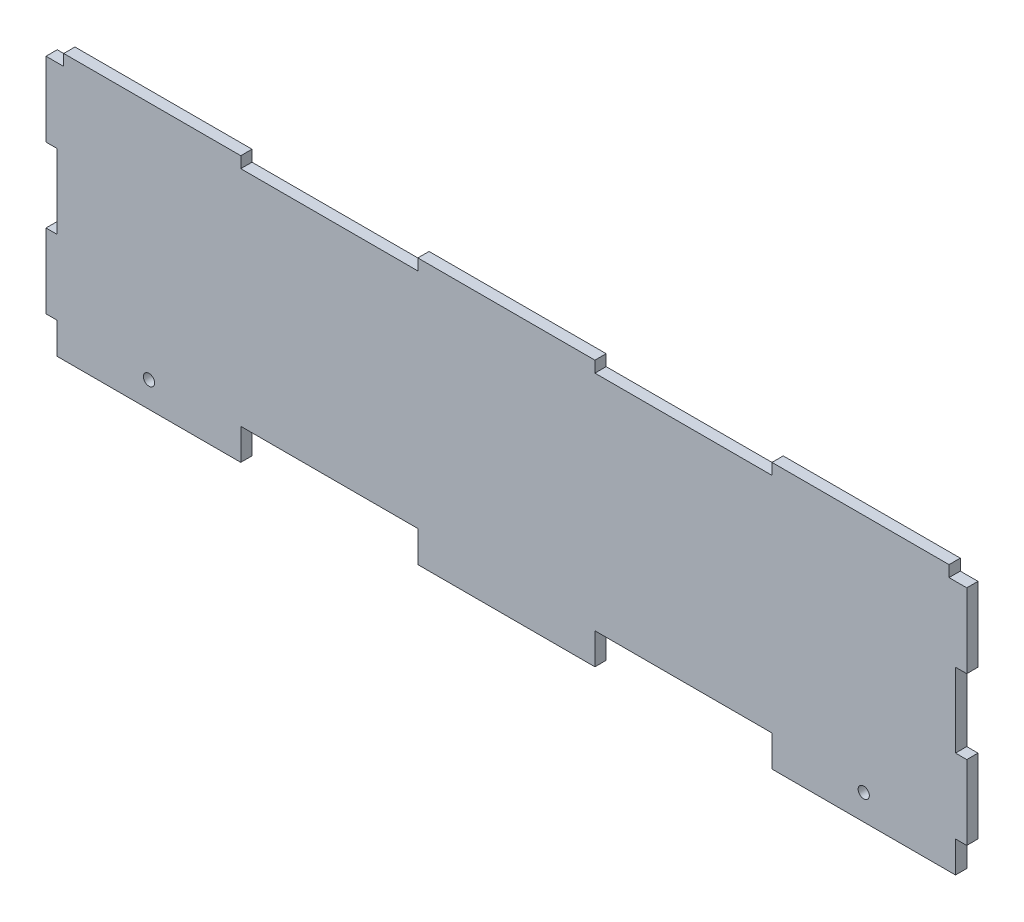
ISO-10303-21;
HEADER;
FILE_DESCRIPTION(('STEP AP214'),'2;1');
FILE_NAME('part.step','',(''),(''),'','','');
FILE_SCHEMA(('AUTOMOTIVE_DESIGN { 1 0 10303 214 1 1 1 1 }'));
ENDSEC;
DATA;
#1=APPLICATION_CONTEXT('core data for automotive mechanical design processes');
#2=APPLICATION_PROTOCOL_DEFINITION('international standard','automotive_design',2000,#1);
#3=PRODUCT_CONTEXT('',#1,'mechanical');
#4=PRODUCT('Part','Part','',(#3));
#5=PRODUCT_RELATED_PRODUCT_CATEGORY('part','',(#4));
#6=PRODUCT_DEFINITION_FORMATION('','',#4);
#7=PRODUCT_DEFINITION_CONTEXT('part definition',#1,'design');
#8=PRODUCT_DEFINITION('design','',#6,#7);
#9=PRODUCT_DEFINITION_SHAPE('','',#8);
#10=(LENGTH_UNIT() NAMED_UNIT(*) SI_UNIT(.MILLI.,.METRE.));
#11=(NAMED_UNIT(*) PLANE_ANGLE_UNIT() SI_UNIT($,.RADIAN.));
#12=(NAMED_UNIT(*) SI_UNIT($,.STERADIAN.) SOLID_ANGLE_UNIT());
#13=UNCERTAINTY_MEASURE_WITH_UNIT(LENGTH_MEASURE(1.E-05),#10,'distance_accuracy_value','');
#14=(GEOMETRIC_REPRESENTATION_CONTEXT(3) GLOBAL_UNCERTAINTY_ASSIGNED_CONTEXT((#13)) GLOBAL_UNIT_ASSIGNED_CONTEXT((#10,
#11,#12)) REPRESENTATION_CONTEXT('',''));
#15=CARTESIAN_POINT('',(0.,0.,0.));
#16=DIRECTION('',(0.,0.,1.));
#17=DIRECTION('',(1.,0.,0.));
#18=AXIS2_PLACEMENT_3D('',#15,#16,#17);
#19=CARTESIAN_POINT('',(155.,0.,3.175));
#20=DIRECTION('',(1.,0.,0.));
#21=DIRECTION('',(0.,0.,-1.));
#22=AXIS2_PLACEMENT_3D('',#19,#20,#21);
#23=PLANE('',#22);
#24=DIRECTION('',(0.,-1.,0.));
#25=VECTOR('',#24,1.);
#26=CARTESIAN_POINT('',(155.,0.,0.));
#27=LINE('',#26,#25);
#28=CARTESIAN_POINT('',(155.,8.82500000000004,0.));
#29=VERTEX_POINT('',#28);
#30=CARTESIAN_POINT('',(155.,0.,0.));
#31=VERTEX_POINT('',#30);
#32=EDGE_CURVE('E381',#29,#31,#27,.T.);
#33=ORIENTED_EDGE('',*,*,#32,.F.);
#34=DIRECTION('',(0.,0.,-1.));
#35=VECTOR('',#34,1.);
#36=CARTESIAN_POINT('',(155.,8.82500000000004,3.175));
#37=LINE('',#36,#35);
#38=CARTESIAN_POINT('',(155.,8.82500000000004,3.175));
#39=VERTEX_POINT('',#38);
#40=EDGE_CURVE('E11',#39,#29,#37,.T.);
#41=ORIENTED_EDGE('',*,*,#40,.F.);
#42=DIRECTION('',(0.,-1.,0.));
#43=VECTOR('',#42,1.);
#44=CARTESIAN_POINT('',(155.,0.,3.175));
#45=LINE('',#44,#43);
#46=CARTESIAN_POINT('',(155.,0.,3.175));
#47=VERTEX_POINT('',#46);
#48=EDGE_CURVE('E482',#39,#47,#45,.T.);
#49=ORIENTED_EDGE('',*,*,#48,.T.);
#50=DIRECTION('',(0.,0.,-1.));
#51=VECTOR('',#50,1.);
#52=CARTESIAN_POINT('',(155.,0.,3.175));
#53=LINE('',#52,#51);
#54=EDGE_CURVE('E170',#47,#31,#53,.T.);
#55=ORIENTED_EDGE('',*,*,#54,.T.);
#56=EDGE_LOOP('',(#33,#41,#49,#55));
#57=FACE_BOUND('',#56,.T.);
#58=ADVANCED_FACE('F35',(#57),#23,.T.);
#59=CARTESIAN_POINT('',(0.,8.82500000000004,3.175));
#60=DIRECTION('',(0.,1.,0.));
#61=DIRECTION('',(0.,0.,1.));
#62=AXIS2_PLACEMENT_3D('',#59,#60,#61);
#63=PLANE('',#62);
#64=DIRECTION('',(1.,0.,0.));
#65=VECTOR('',#64,1.);
#66=CARTESIAN_POINT('',(0.,8.82500000000004,0.));
#67=LINE('',#66,#65);
#68=CARTESIAN_POINT('',(205.,8.82500000000004,0.));
#69=VERTEX_POINT('',#68);
#70=EDGE_CURVE('E379',#29,#69,#67,.T.);
#71=ORIENTED_EDGE('',*,*,#70,.T.);
#72=DIRECTION('',(0.,0.,-1.));
#73=VECTOR('',#72,1.);
#74=CARTESIAN_POINT('',(205.,8.82500000000004,3.175));
#75=LINE('',#74,#73);
#76=CARTESIAN_POINT('',(205.,8.82500000000004,3.175));
#77=VERTEX_POINT('',#76);
#78=EDGE_CURVE('E44',#77,#69,#75,.T.);
#79=ORIENTED_EDGE('',*,*,#78,.F.);
#80=DIRECTION('',(1.,0.,0.));
#81=VECTOR('',#80,1.);
#82=CARTESIAN_POINT('',(0.,8.82500000000004,3.175));
#83=LINE('',#82,#81);
#84=EDGE_CURVE('E481',#39,#77,#83,.T.);
#85=ORIENTED_EDGE('',*,*,#84,.F.);
#86=ORIENTED_EDGE('',*,*,#40,.T.);
#87=EDGE_LOOP('',(#71,#79,#85,#86));
#88=FACE_BOUND('',#87,.T.);
#89=ADVANCED_FACE('F380',(#88),#63,.F.);
#90=CARTESIAN_POINT('',(205.,6.44747082289398E-13,3.175));
#91=DIRECTION('',(1.,0.,0.));
#92=DIRECTION('',(0.,1.,0.));
#93=AXIS2_PLACEMENT_3D('',#90,#91,#92);
#94=PLANE('',#93);
#95=DIRECTION('',(0.,-1.,0.));
#96=VECTOR('',#95,1.);
#97=CARTESIAN_POINT('',(205.,6.44747082289398E-13,0.));
#98=LINE('',#97,#96);
#99=CARTESIAN_POINT('',(205.,0.,0.));
#100=VERTEX_POINT('',#99);
#101=EDGE_CURVE('E373',#69,#100,#98,.T.);
#102=ORIENTED_EDGE('',*,*,#101,.T.);
#103=DIRECTION('',(0.,0.,-1.));
#104=VECTOR('',#103,1.);
#105=CARTESIAN_POINT('',(205.,0.,3.175));
#106=LINE('',#105,#104);
#107=CARTESIAN_POINT('',(205.,0.,3.175));
#108=VERTEX_POINT('',#107);
#109=EDGE_CURVE('E364',#108,#100,#106,.T.);
#110=ORIENTED_EDGE('',*,*,#109,.F.);
#111=DIRECTION('',(0.,-1.,0.));
#112=VECTOR('',#111,1.);
#113=CARTESIAN_POINT('',(205.,6.44747082289398E-13,3.175));
#114=LINE('',#113,#112);
#115=EDGE_CURVE('E375',#77,#108,#114,.T.);
#116=ORIENTED_EDGE('',*,*,#115,.F.);
#117=ORIENTED_EDGE('',*,*,#78,.T.);
#118=EDGE_LOOP('',(#102,#110,#116,#117));
#119=FACE_BOUND('',#118,.T.);
#120=ADVANCED_FACE('F371',(#119),#94,.F.);
#121=CARTESIAN_POINT('',(0.,0.,3.175));
#122=DIRECTION('',(0.,1.,0.));
#123=DIRECTION('',(0.,0.,1.));
#124=AXIS2_PLACEMENT_3D('',#121,#122,#123);
#125=PLANE('',#124);
#126=DIRECTION('',(1.,0.,0.));
#127=VECTOR('',#126,1.);
#128=CARTESIAN_POINT('',(0.,0.,0.));
#129=LINE('',#128,#127);
#130=CARTESIAN_POINT('',(256.825,0.,0.));
#131=VERTEX_POINT('',#130);
#132=EDGE_CURVE('E383',#100,#131,#129,.T.);
#133=ORIENTED_EDGE('',*,*,#132,.T.);
#134=DIRECTION('',(0.,0.,-1.));
#135=VECTOR('',#134,1.);
#136=CARTESIAN_POINT('',(256.825,0.,3.175));
#137=LINE('',#136,#135);
#138=CARTESIAN_POINT('',(256.825,0.,3.175));
#139=VERTEX_POINT('',#138);
#140=EDGE_CURVE('E361',#139,#131,#137,.T.);
#141=ORIENTED_EDGE('',*,*,#140,.F.);
#142=DIRECTION('',(1.,0.,0.));
#143=VECTOR('',#142,1.);
#144=CARTESIAN_POINT('',(0.,0.,3.175));
#145=LINE('',#144,#143);
#146=EDGE_CURVE('E472',#108,#139,#145,.T.);
#147=ORIENTED_EDGE('',*,*,#146,.F.);
#148=ORIENTED_EDGE('',*,*,#109,.T.);
#149=EDGE_LOOP('',(#133,#141,#147,#148));
#150=FACE_BOUND('',#149,.T.);
#151=ADVANCED_FACE('F533',(#150),#125,.F.);
#152=CARTESIAN_POINT('',(256.825,0.,3.175));
#153=DIRECTION('',(-1.,0.,0.));
#154=DIRECTION('',(0.,0.,1.));
#155=AXIS2_PLACEMENT_3D('',#152,#153,#154);
#156=PLANE('',#155);
#157=DIRECTION('',(0.,1.,0.));
#158=VECTOR('',#157,1.);
#159=CARTESIAN_POINT('',(256.825,0.,0.));
#160=LINE('',#159,#158);
#161=CARTESIAN_POINT('',(256.825,8.82500000000004,0.));
#162=VERTEX_POINT('',#161);
#163=EDGE_CURVE('E391',#131,#162,#160,.T.);
#164=ORIENTED_EDGE('',*,*,#163,.T.);
#165=DIRECTION('',(0.,0.,-1.));
#166=VECTOR('',#165,1.);
#167=CARTESIAN_POINT('',(256.825,8.82500000000004,3.175));
#168=LINE('',#167,#166);
#169=CARTESIAN_POINT('',(256.825,8.82500000000004,3.175));
#170=VERTEX_POINT('',#169);
#171=EDGE_CURVE('E358',#170,#162,#168,.T.);
#172=ORIENTED_EDGE('',*,*,#171,.F.);
#173=DIRECTION('',(0.,1.,0.));
#174=VECTOR('',#173,1.);
#175=CARTESIAN_POINT('',(256.825,0.,3.175));
#176=LINE('',#175,#174);
#177=EDGE_CURVE('E477',#139,#170,#176,.T.);
#178=ORIENTED_EDGE('',*,*,#177,.F.);
#179=ORIENTED_EDGE('',*,*,#140,.T.);
#180=EDGE_LOOP('',(#164,#172,#178,#179));
#181=FACE_BOUND('',#180,.T.);
#182=ADVANCED_FACE('F534',(#181),#156,.F.);
#183=CARTESIAN_POINT('',(0.,8.82499999999822,3.175));
#184=DIRECTION('',(0.,1.,0.));
#185=DIRECTION('',(-1.,0.,0.));
#186=AXIS2_PLACEMENT_3D('',#183,#184,#185);
#187=PLANE('',#186);
#188=DIRECTION('',(1.,0.,0.));
#189=VECTOR('',#188,1.);
#190=CARTESIAN_POINT('',(0.,8.82499999999822,0.));
#191=LINE('',#190,#189);
#192=CARTESIAN_POINT('',(260.,8.82500000000005,0.));
#193=VERTEX_POINT('',#192);
#194=EDGE_CURVE('E395',#162,#193,#191,.T.);
#195=ORIENTED_EDGE('',*,*,#194,.T.);
#196=DIRECTION('',(0.,0.,-1.));
#197=VECTOR('',#196,1.);
#198=CARTESIAN_POINT('',(260.,8.82500000000005,3.175));
#199=LINE('',#198,#197);
#200=CARTESIAN_POINT('',(260.,8.82500000000005,3.175));
#201=VERTEX_POINT('',#200);
#202=EDGE_CURVE('E356',#201,#193,#199,.T.);
#203=ORIENTED_EDGE('',*,*,#202,.F.);
#204=DIRECTION('',(1.,0.,0.));
#205=VECTOR('',#204,1.);
#206=CARTESIAN_POINT('',(0.,8.82499999999822,3.175));
#207=LINE('',#206,#205);
#208=EDGE_CURVE('E480',#170,#201,#207,.T.);
#209=ORIENTED_EDGE('',*,*,#208,.F.);
#210=ORIENTED_EDGE('',*,*,#171,.T.);
#211=EDGE_LOOP('',(#195,#203,#209,#210));
#212=FACE_BOUND('',#211,.T.);
#213=ADVANCED_FACE('F537',(#212),#187,.F.);
#214=CARTESIAN_POINT('',(260.,0.,3.175));
#215=DIRECTION('',(1.,0.,0.));
#216=DIRECTION('',(0.,0.,-1.));
#217=AXIS2_PLACEMENT_3D('',#214,#215,#216);
#218=PLANE('',#217);
#219=DIRECTION('',(0.,-1.,0.));
#220=VECTOR('',#219,1.);
#221=CARTESIAN_POINT('',(260.,0.,0.));
#222=LINE('',#221,#220);
#223=CARTESIAN_POINT('',(260.,29.8250000000001,0.));
#224=VERTEX_POINT('',#223);
#225=EDGE_CURVE('E398',#224,#193,#222,.T.);
#226=ORIENTED_EDGE('',*,*,#225,.F.);
#227=DIRECTION('',(0.,0.,-1.));
#228=VECTOR('',#227,1.);
#229=CARTESIAN_POINT('',(260.,29.8250000000001,3.175));
#230=LINE('',#229,#228);
#231=CARTESIAN_POINT('',(260.,29.8250000000001,3.175));
#232=VERTEX_POINT('',#231);
#233=EDGE_CURVE('E354',#232,#224,#230,.T.);
#234=ORIENTED_EDGE('',*,*,#233,.F.);
#235=DIRECTION('',(0.,-1.,0.));
#236=VECTOR('',#235,1.);
#237=CARTESIAN_POINT('',(260.,0.,3.175));
#238=LINE('',#237,#236);
#239=EDGE_CURVE('E894',#232,#201,#238,.T.);
#240=ORIENTED_EDGE('',*,*,#239,.T.);
#241=ORIENTED_EDGE('',*,*,#202,.T.);
#242=EDGE_LOOP('',(#226,#234,#240,#241));
#243=FACE_BOUND('',#242,.T.);
#244=ADVANCED_FACE('F541',(#243),#218,.T.);
#245=CARTESIAN_POINT('',(0.,29.8250000000001,3.175));
#246=DIRECTION('',(0.,1.,0.));
#247=DIRECTION('',(0.,0.,1.));
#248=AXIS2_PLACEMENT_3D('',#245,#246,#247);
#249=PLANE('',#248);
#250=DIRECTION('',(1.,0.,0.));
#251=VECTOR('',#250,1.);
#252=CARTESIAN_POINT('',(0.,29.8250000000001,0.));
#253=LINE('',#252,#251);
#254=CARTESIAN_POINT('',(256.825,29.8250000000001,0.));
#255=VERTEX_POINT('',#254);
#256=EDGE_CURVE('E401',#255,#224,#253,.T.);
#257=ORIENTED_EDGE('',*,*,#256,.F.);
#258=DIRECTION('',(0.,0.,-1.));
#259=VECTOR('',#258,1.);
#260=CARTESIAN_POINT('',(256.825,29.8250000000001,3.175));
#261=LINE('',#260,#259);
#262=CARTESIAN_POINT('',(256.825,29.8250000000001,3.175));
#263=VERTEX_POINT('',#262);
#264=EDGE_CURVE('E352',#263,#255,#261,.T.);
#265=ORIENTED_EDGE('',*,*,#264,.F.);
#266=DIRECTION('',(1.,0.,0.));
#267=VECTOR('',#266,1.);
#268=CARTESIAN_POINT('',(0.,29.8250000000001,3.175));
#269=LINE('',#268,#267);
#270=EDGE_CURVE('E898',#263,#232,#269,.T.);
#271=ORIENTED_EDGE('',*,*,#270,.T.);
#272=ORIENTED_EDGE('',*,*,#233,.T.);
#273=EDGE_LOOP('',(#257,#265,#271,#272));
#274=FACE_BOUND('',#273,.T.);
#275=ADVANCED_FACE('F543',(#274),#249,.T.);
#276=CARTESIAN_POINT('',(256.825,0.,3.175));
#277=DIRECTION('',(1.,0.,0.));
#278=DIRECTION('',(0.,0.,-1.));
#279=AXIS2_PLACEMENT_3D('',#276,#277,#278);
#280=PLANE('',#279);
#281=DIRECTION('',(0.,-1.,0.));
#282=VECTOR('',#281,1.);
#283=CARTESIAN_POINT('',(256.825,0.,0.));
#284=LINE('',#283,#282);
#285=CARTESIAN_POINT('',(256.825,50.8250000000001,0.));
#286=VERTEX_POINT('',#285);
#287=EDGE_CURVE('E405',#286,#255,#284,.T.);
#288=ORIENTED_EDGE('',*,*,#287,.F.);
#289=DIRECTION('',(0.,0.,-1.));
#290=VECTOR('',#289,1.);
#291=CARTESIAN_POINT('',(256.825,50.8250000000001,3.175));
#292=LINE('',#291,#290);
#293=CARTESIAN_POINT('',(256.825,50.8250000000001,3.175));
#294=VERTEX_POINT('',#293);
#295=EDGE_CURVE('E350',#294,#286,#292,.T.);
#296=ORIENTED_EDGE('',*,*,#295,.F.);
#297=DIRECTION('',(0.,-1.,0.));
#298=VECTOR('',#297,1.);
#299=CARTESIAN_POINT('',(256.825,0.,3.175));
#300=LINE('',#299,#298);
#301=EDGE_CURVE('E901',#294,#263,#300,.T.);
#302=ORIENTED_EDGE('',*,*,#301,.T.);
#303=ORIENTED_EDGE('',*,*,#264,.T.);
#304=EDGE_LOOP('',(#288,#296,#302,#303));
#305=FACE_BOUND('',#304,.T.);
#306=ADVANCED_FACE('F546',(#305),#280,.T.);
#307=CARTESIAN_POINT('',(0.,50.8250000000001,3.175));
#308=DIRECTION('',(0.,-1.,0.));
#309=DIRECTION('',(0.,0.,-1.));
#310=AXIS2_PLACEMENT_3D('',#307,#308,#309);
#311=PLANE('',#310);
#312=DIRECTION('',(-1.,0.,0.));
#313=VECTOR('',#312,1.);
#314=CARTESIAN_POINT('',(0.,50.8250000000001,0.));
#315=LINE('',#314,#313);
#316=CARTESIAN_POINT('',(260.,50.8250000000001,0.));
#317=VERTEX_POINT('',#316);
#318=EDGE_CURVE('E408',#317,#286,#315,.T.);
#319=ORIENTED_EDGE('',*,*,#318,.F.);
#320=DIRECTION('',(0.,0.,-1.));
#321=VECTOR('',#320,1.);
#322=CARTESIAN_POINT('',(260.,50.8250000000001,3.175));
#323=LINE('',#322,#321);
#324=CARTESIAN_POINT('',(260.,50.8250000000001,3.175));
#325=VERTEX_POINT('',#324);
#326=EDGE_CURVE('E348',#325,#317,#323,.T.);
#327=ORIENTED_EDGE('',*,*,#326,.F.);
#328=DIRECTION('',(-1.,0.,0.));
#329=VECTOR('',#328,1.);
#330=CARTESIAN_POINT('',(0.,50.8250000000001,3.175));
#331=LINE('',#330,#329);
#332=EDGE_CURVE('E905',#325,#294,#331,.T.);
#333=ORIENTED_EDGE('',*,*,#332,.T.);
#334=ORIENTED_EDGE('',*,*,#295,.T.);
#335=EDGE_LOOP('',(#319,#327,#333,#334));
#336=FACE_BOUND('',#335,.T.);
#337=ADVANCED_FACE('F550',(#336),#311,.T.);
#338=CARTESIAN_POINT('',(260.,71.825,0.));
#339=VERTEX_POINT('',#338);
#340=EDGE_CURVE('E402',#339,#317,#222,.T.);
#341=ORIENTED_EDGE('',*,*,#340,.F.);
#342=DIRECTION('',(0.,0.,-1.));
#343=VECTOR('',#342,1.);
#344=CARTESIAN_POINT('',(260.,71.825,3.175));
#345=LINE('',#344,#343);
#346=CARTESIAN_POINT('',(260.,71.825,3.175));
#347=VERTEX_POINT('',#346);
#348=EDGE_CURVE('E346',#347,#339,#345,.T.);
#349=ORIENTED_EDGE('',*,*,#348,.F.);
#350=EDGE_CURVE('E900',#347,#325,#238,.T.);
#351=ORIENTED_EDGE('',*,*,#350,.T.);
#352=ORIENTED_EDGE('',*,*,#326,.T.);
#353=EDGE_LOOP('',(#341,#349,#351,#352));
#354=FACE_BOUND('',#353,.T.);
#355=ADVANCED_FACE('F554',(#354),#218,.T.);
#356=CARTESIAN_POINT('',(0.,71.825,3.175));
#357=DIRECTION('',(0.,1.,0.));
#358=DIRECTION('',(0.,0.,1.));
#359=AXIS2_PLACEMENT_3D('',#356,#357,#358);
#360=PLANE('',#359);
#361=DIRECTION('',(1.,0.,0.));
#362=VECTOR('',#361,1.);
#363=CARTESIAN_POINT('',(0.,71.825,0.));
#364=LINE('',#363,#362);
#365=CARTESIAN_POINT('',(255.,71.825,0.));
#366=VERTEX_POINT('',#365);
#367=EDGE_CURVE('E411',#366,#339,#364,.T.);
#368=ORIENTED_EDGE('',*,*,#367,.F.);
#369=DIRECTION('',(0.,0.,-1.));
#370=VECTOR('',#369,1.);
#371=CARTESIAN_POINT('',(255.,71.825,3.175));
#372=LINE('',#371,#370);
#373=CARTESIAN_POINT('',(255.,71.825,3.175));
#374=VERTEX_POINT('',#373);
#375=EDGE_CURVE('E344',#374,#366,#372,.T.);
#376=ORIENTED_EDGE('',*,*,#375,.F.);
#377=DIRECTION('',(1.,0.,0.));
#378=VECTOR('',#377,1.);
#379=CARTESIAN_POINT('',(0.,71.825,3.175));
#380=LINE('',#379,#378);
#381=EDGE_CURVE('E904',#374,#347,#380,.T.);
#382=ORIENTED_EDGE('',*,*,#381,.T.);
#383=ORIENTED_EDGE('',*,*,#348,.T.);
#384=EDGE_LOOP('',(#368,#376,#382,#383));
#385=FACE_BOUND('',#384,.T.);
#386=ADVANCED_FACE('F558',(#385),#360,.T.);
#387=CARTESIAN_POINT('',(255.,0.,3.175));
#388=DIRECTION('',(1.,0.,0.));
#389=DIRECTION('',(0.,0.,-1.));
#390=AXIS2_PLACEMENT_3D('',#387,#388,#389);
#391=PLANE('',#390);
#392=DIRECTION('',(0.,-1.,0.));
#393=VECTOR('',#392,1.);
#394=CARTESIAN_POINT('',(255.,0.,0.));
#395=LINE('',#394,#393);
#396=CARTESIAN_POINT('',(255.,75.,0.));
#397=VERTEX_POINT('',#396);
#398=EDGE_CURVE('E414',#397,#366,#395,.T.);
#399=ORIENTED_EDGE('',*,*,#398,.F.);
#400=DIRECTION('',(0.,0.,-1.));
#401=VECTOR('',#400,1.);
#402=CARTESIAN_POINT('',(255.,75.,3.175));
#403=LINE('',#402,#401);
#404=CARTESIAN_POINT('',(255.,75.,3.175));
#405=VERTEX_POINT('',#404);
#406=EDGE_CURVE('E342',#405,#397,#403,.T.);
#407=ORIENTED_EDGE('',*,*,#406,.F.);
#408=DIRECTION('',(0.,-1.,0.));
#409=VECTOR('',#408,1.);
#410=CARTESIAN_POINT('',(255.,0.,3.175));
#411=LINE('',#410,#409);
#412=EDGE_CURVE('E908',#405,#374,#411,.T.);
#413=ORIENTED_EDGE('',*,*,#412,.T.);
#414=ORIENTED_EDGE('',*,*,#375,.T.);
#415=EDGE_LOOP('',(#399,#407,#413,#414));
#416=FACE_BOUND('',#415,.T.);
#417=ADVANCED_FACE('F562',(#416),#391,.T.);
#418=CARTESIAN_POINT('',(0.,75.,3.175));
#419=DIRECTION('',(0.,1.,0.));
#420=DIRECTION('',(0.,0.,1.));
#421=AXIS2_PLACEMENT_3D('',#418,#419,#420);
#422=PLANE('',#421);
#423=DIRECTION('',(1.,0.,0.));
#424=VECTOR('',#423,1.);
#425=CARTESIAN_POINT('',(0.,75.,0.));
#426=LINE('',#425,#424);
#427=CARTESIAN_POINT('',(205.,75.,0.));
#428=VERTEX_POINT('',#427);
#429=EDGE_CURVE('E417',#428,#397,#426,.T.);
#430=ORIENTED_EDGE('',*,*,#429,.F.);
#431=DIRECTION('',(0.,0.,-1.));
#432=VECTOR('',#431,1.);
#433=CARTESIAN_POINT('',(205.,75.,3.175));
#434=LINE('',#433,#432);
#435=CARTESIAN_POINT('',(205.,75.,3.175));
#436=VERTEX_POINT('',#435);
#437=EDGE_CURVE('E340',#436,#428,#434,.T.);
#438=ORIENTED_EDGE('',*,*,#437,.F.);
#439=DIRECTION('',(1.,0.,0.));
#440=VECTOR('',#439,1.);
#441=CARTESIAN_POINT('',(0.,75.,3.175));
#442=LINE('',#441,#440);
#443=EDGE_CURVE('E918',#436,#405,#442,.T.);
#444=ORIENTED_EDGE('',*,*,#443,.T.);
#445=ORIENTED_EDGE('',*,*,#406,.T.);
#446=EDGE_LOOP('',(#430,#438,#444,#445));
#447=FACE_BOUND('',#446,.T.);
#448=ADVANCED_FACE('F566',(#447),#422,.T.);
#449=CARTESIAN_POINT('',(205.,0.,3.175));
#450=DIRECTION('',(-1.,0.,0.));
#451=DIRECTION('',(0.,0.,1.));
#452=AXIS2_PLACEMENT_3D('',#449,#450,#451);
#453=PLANE('',#452);
#454=DIRECTION('',(0.,1.,0.));
#455=VECTOR('',#454,1.);
#456=CARTESIAN_POINT('',(205.,0.,0.));
#457=LINE('',#456,#455);
#458=CARTESIAN_POINT('',(205.,71.825,0.));
#459=VERTEX_POINT('',#458);
#460=EDGE_CURVE('E420',#459,#428,#457,.T.);
#461=ORIENTED_EDGE('',*,*,#460,.F.);
#462=DIRECTION('',(0.,0.,-1.));
#463=VECTOR('',#462,1.);
#464=CARTESIAN_POINT('',(205.,71.825,3.175));
#465=LINE('',#464,#463);
#466=CARTESIAN_POINT('',(205.,71.825,3.175));
#467=VERTEX_POINT('',#466);
#468=EDGE_CURVE('E338',#467,#459,#465,.T.);
#469=ORIENTED_EDGE('',*,*,#468,.F.);
#470=DIRECTION('',(0.,1.,0.));
#471=VECTOR('',#470,1.);
#472=CARTESIAN_POINT('',(205.,0.,3.175));
#473=LINE('',#472,#471);
#474=EDGE_CURVE('E921',#467,#436,#473,.T.);
#475=ORIENTED_EDGE('',*,*,#474,.T.);
#476=ORIENTED_EDGE('',*,*,#437,.T.);
#477=EDGE_LOOP('',(#461,#469,#475,#476));
#478=FACE_BOUND('',#477,.T.);
#479=ADVANCED_FACE('F568',(#478),#453,.T.);
#480=CARTESIAN_POINT('',(0.,71.825,3.175));
#481=DIRECTION('',(0.,1.,0.));
#482=DIRECTION('',(-1.,0.,0.));
#483=AXIS2_PLACEMENT_3D('',#480,#481,#482);
#484=PLANE('',#483);
#485=DIRECTION('',(1.,0.,0.));
#486=VECTOR('',#485,1.);
#487=CARTESIAN_POINT('',(0.,71.825,0.));
#488=LINE('',#487,#486);
#489=CARTESIAN_POINT('',(155.,71.825,0.));
#490=VERTEX_POINT('',#489);
#491=EDGE_CURVE('E425',#490,#459,#488,.T.);
#492=ORIENTED_EDGE('',*,*,#491,.F.);
#493=DIRECTION('',(0.,0.,-1.));
#494=VECTOR('',#493,1.);
#495=CARTESIAN_POINT('',(155.,71.825,3.175));
#496=LINE('',#495,#494);
#497=CARTESIAN_POINT('',(155.,71.825,3.175));
#498=VERTEX_POINT('',#497);
#499=EDGE_CURVE('E336',#498,#490,#496,.T.);
#500=ORIENTED_EDGE('',*,*,#499,.F.);
#501=DIRECTION('',(1.,0.,0.));
#502=VECTOR('',#501,1.);
#503=CARTESIAN_POINT('',(0.,71.825,3.175));
#504=LINE('',#503,#502);
#505=EDGE_CURVE('E926',#498,#467,#504,.T.);
#506=ORIENTED_EDGE('',*,*,#505,.T.);
#507=ORIENTED_EDGE('',*,*,#468,.T.);
#508=EDGE_LOOP('',(#492,#500,#506,#507));
#509=FACE_BOUND('',#508,.T.);
#510=ADVANCED_FACE('F571',(#509),#484,.T.);
#511=CARTESIAN_POINT('',(155.,0.,3.175));
#512=DIRECTION('',(-1.,0.,0.));
#513=DIRECTION('',(0.,0.,1.));
#514=AXIS2_PLACEMENT_3D('',#511,#512,#513);
#515=PLANE('',#514);
#516=DIRECTION('',(0.,1.,0.));
#517=VECTOR('',#516,1.);
#518=CARTESIAN_POINT('',(155.,0.,0.));
#519=LINE('',#518,#517);
#520=CARTESIAN_POINT('',(155.,75.,0.));
#521=VERTEX_POINT('',#520);
#522=EDGE_CURVE('E428',#490,#521,#519,.T.);
#523=ORIENTED_EDGE('',*,*,#522,.T.);
#524=DIRECTION('',(0.,0.,-1.));
#525=VECTOR('',#524,1.);
#526=CARTESIAN_POINT('',(155.,75.,3.175));
#527=LINE('',#526,#525);
#528=CARTESIAN_POINT('',(155.,75.,3.175));
#529=VERTEX_POINT('',#528);
#530=EDGE_CURVE('E334',#529,#521,#527,.T.);
#531=ORIENTED_EDGE('',*,*,#530,.F.);
#532=DIRECTION('',(0.,1.,0.));
#533=VECTOR('',#532,1.);
#534=CARTESIAN_POINT('',(155.,0.,3.175));
#535=LINE('',#534,#533);
#536=EDGE_CURVE('E929',#498,#529,#535,.T.);
#537=ORIENTED_EDGE('',*,*,#536,.F.);
#538=ORIENTED_EDGE('',*,*,#499,.T.);
#539=EDGE_LOOP('',(#523,#531,#537,#538));
#540=FACE_BOUND('',#539,.T.);
#541=ADVANCED_FACE('F575',(#540),#515,.F.);
#542=CARTESIAN_POINT('',(105.,75.,0.));
#543=VERTEX_POINT('',#542);
#544=EDGE_CURVE('E422',#543,#521,#426,.T.);
#545=ORIENTED_EDGE('',*,*,#544,.F.);
#546=DIRECTION('',(0.,0.,-1.));
#547=VECTOR('',#546,1.);
#548=CARTESIAN_POINT('',(105.,75.,3.175));
#549=LINE('',#548,#547);
#550=CARTESIAN_POINT('',(105.,75.,3.175));
#551=VERTEX_POINT('',#550);
#552=EDGE_CURVE('E332',#551,#543,#549,.T.);
#553=ORIENTED_EDGE('',*,*,#552,.F.);
#554=EDGE_CURVE('E923',#551,#529,#442,.T.);
#555=ORIENTED_EDGE('',*,*,#554,.T.);
#556=ORIENTED_EDGE('',*,*,#530,.T.);
#557=EDGE_LOOP('',(#545,#553,#555,#556));
#558=FACE_BOUND('',#557,.T.);
#559=ADVANCED_FACE('F579',(#558),#422,.T.);
#560=CARTESIAN_POINT('',(105.,0.,3.175));
#561=DIRECTION('',(1.,0.,0.));
#562=DIRECTION('',(0.,0.,-1.));
#563=AXIS2_PLACEMENT_3D('',#560,#561,#562);
#564=PLANE('',#563);
#565=DIRECTION('',(0.,-1.,0.));
#566=VECTOR('',#565,1.);
#567=CARTESIAN_POINT('',(105.,0.,0.));
#568=LINE('',#567,#566);
#569=CARTESIAN_POINT('',(105.,71.825,0.));
#570=VERTEX_POINT('',#569);
#571=EDGE_CURVE('E431',#543,#570,#568,.T.);
#572=ORIENTED_EDGE('',*,*,#571,.T.);
#573=DIRECTION('',(0.,0.,-1.));
#574=VECTOR('',#573,1.);
#575=CARTESIAN_POINT('',(105.,71.825,3.175));
#576=LINE('',#575,#574);
#577=CARTESIAN_POINT('',(105.,71.825,3.175));
#578=VERTEX_POINT('',#577);
#579=EDGE_CURVE('E330',#578,#570,#576,.T.);
#580=ORIENTED_EDGE('',*,*,#579,.F.);
#581=DIRECTION('',(0.,-1.,0.));
#582=VECTOR('',#581,1.);
#583=CARTESIAN_POINT('',(105.,0.,3.175));
#584=LINE('',#583,#582);
#585=EDGE_CURVE('E931',#551,#578,#584,.T.);
#586=ORIENTED_EDGE('',*,*,#585,.F.);
#587=ORIENTED_EDGE('',*,*,#552,.T.);
#588=EDGE_LOOP('',(#572,#580,#586,#587));
#589=FACE_BOUND('',#588,.T.);
#590=ADVANCED_FACE('F581',(#589),#564,.F.);
#591=CARTESIAN_POINT('',(0.,71.825,3.175));
#592=DIRECTION('',(0.,1.,0.));
#593=DIRECTION('',(0.,0.,1.));
#594=AXIS2_PLACEMENT_3D('',#591,#592,#593);
#595=PLANE('',#594);
#596=DIRECTION('',(1.,0.,0.));
#597=VECTOR('',#596,1.);
#598=CARTESIAN_POINT('',(0.,71.825,0.));
#599=LINE('',#598,#597);
#600=CARTESIAN_POINT('',(55.,71.825,0.));
#601=VERTEX_POINT('',#600);
#602=EDGE_CURVE('E434',#601,#570,#599,.T.);
#603=ORIENTED_EDGE('',*,*,#602,.F.);
#604=DIRECTION('',(0.,0.,-1.));
#605=VECTOR('',#604,1.);
#606=CARTESIAN_POINT('',(55.,71.825,3.175));
#607=LINE('',#606,#605);
#608=CARTESIAN_POINT('',(55.,71.825,3.175));
#609=VERTEX_POINT('',#608);
#610=EDGE_CURVE('E328',#609,#601,#607,.T.);
#611=ORIENTED_EDGE('',*,*,#610,.F.);
#612=DIRECTION('',(1.,0.,0.));
#613=VECTOR('',#612,1.);
#614=CARTESIAN_POINT('',(0.,71.825,3.175));
#615=LINE('',#614,#613);
#616=EDGE_CURVE('E933',#609,#578,#615,.T.);
#617=ORIENTED_EDGE('',*,*,#616,.T.);
#618=ORIENTED_EDGE('',*,*,#579,.T.);
#619=EDGE_LOOP('',(#603,#611,#617,#618));
#620=FACE_BOUND('',#619,.T.);
#621=ADVANCED_FACE('F584',(#620),#595,.T.);
#622=CARTESIAN_POINT('',(55.,0.,3.175));
#623=DIRECTION('',(-1.,0.,0.));
#624=DIRECTION('',(0.,0.,1.));
#625=AXIS2_PLACEMENT_3D('',#622,#623,#624);
#626=PLANE('',#625);
#627=DIRECTION('',(0.,1.,0.));
#628=VECTOR('',#627,1.);
#629=CARTESIAN_POINT('',(55.,0.,0.));
#630=LINE('',#629,#628);
#631=CARTESIAN_POINT('',(55.,75.,0.));
#632=VERTEX_POINT('',#631);
#633=EDGE_CURVE('E437',#601,#632,#630,.T.);
#634=ORIENTED_EDGE('',*,*,#633,.T.);
#635=DIRECTION('',(0.,0.,-1.));
#636=VECTOR('',#635,1.);
#637=CARTESIAN_POINT('',(55.,75.,3.175));
#638=LINE('',#637,#636);
#639=CARTESIAN_POINT('',(55.,75.,3.175));
#640=VERTEX_POINT('',#639);
#641=EDGE_CURVE('E326',#640,#632,#638,.T.);
#642=ORIENTED_EDGE('',*,*,#641,.F.);
#643=DIRECTION('',(0.,1.,0.));
#644=VECTOR('',#643,1.);
#645=CARTESIAN_POINT('',(55.,0.,3.175));
#646=LINE('',#645,#644);
#647=EDGE_CURVE('E936',#609,#640,#646,.T.);
#648=ORIENTED_EDGE('',*,*,#647,.F.);
#649=ORIENTED_EDGE('',*,*,#610,.T.);
#650=EDGE_LOOP('',(#634,#642,#648,#649));
#651=FACE_BOUND('',#650,.T.);
#652=ADVANCED_FACE('F588',(#651),#626,.F.);
#653=CARTESIAN_POINT('',(5.,75.,0.));
#654=VERTEX_POINT('',#653);
#655=EDGE_CURVE('E421',#654,#632,#426,.T.);
#656=ORIENTED_EDGE('',*,*,#655,.F.);
#657=DIRECTION('',(0.,0.,-1.));
#658=VECTOR('',#657,1.);
#659=CARTESIAN_POINT('',(5.,75.,3.175));
#660=LINE('',#659,#658);
#661=CARTESIAN_POINT('',(5.,75.,3.175));
#662=VERTEX_POINT('',#661);
#663=EDGE_CURVE('E324',#662,#654,#660,.T.);
#664=ORIENTED_EDGE('',*,*,#663,.F.);
#665=EDGE_CURVE('E922',#662,#640,#442,.T.);
#666=ORIENTED_EDGE('',*,*,#665,.T.);
#667=ORIENTED_EDGE('',*,*,#641,.T.);
#668=EDGE_LOOP('',(#656,#664,#666,#667));
#669=FACE_BOUND('',#668,.T.);
#670=ADVANCED_FACE('F592',(#669),#422,.T.);
#671=CARTESIAN_POINT('',(5.,0.,3.175));
#672=DIRECTION('',(1.,0.,0.));
#673=DIRECTION('',(0.,0.,-1.));
#674=AXIS2_PLACEMENT_3D('',#671,#672,#673);
#675=PLANE('',#674);
#676=DIRECTION('',(0.,-1.,0.));
#677=VECTOR('',#676,1.);
#678=CARTESIAN_POINT('',(5.,0.,0.));
#679=LINE('',#678,#677);
#680=CARTESIAN_POINT('',(5.,71.825,0.));
#681=VERTEX_POINT('',#680);
#682=EDGE_CURVE('E440',#654,#681,#679,.T.);
#683=ORIENTED_EDGE('',*,*,#682,.T.);
#684=DIRECTION('',(0.,0.,-1.));
#685=VECTOR('',#684,1.);
#686=CARTESIAN_POINT('',(5.,71.825,3.175));
#687=LINE('',#686,#685);
#688=CARTESIAN_POINT('',(5.,71.825,3.175));
#689=VERTEX_POINT('',#688);
#690=EDGE_CURVE('E321',#689,#681,#687,.T.);
#691=ORIENTED_EDGE('',*,*,#690,.F.);
#692=DIRECTION('',(0.,-1.,0.));
#693=VECTOR('',#692,1.);
#694=CARTESIAN_POINT('',(5.,0.,3.175));
#695=LINE('',#694,#693);
#696=EDGE_CURVE('E938',#662,#689,#695,.T.);
#697=ORIENTED_EDGE('',*,*,#696,.F.);
#698=ORIENTED_EDGE('',*,*,#663,.T.);
#699=EDGE_LOOP('',(#683,#691,#697,#698));
#700=FACE_BOUND('',#699,.T.);
#701=ADVANCED_FACE('F596',(#700),#675,.F.);
#702=CARTESIAN_POINT('',(0.,71.825,3.175));
#703=DIRECTION('',(0.,-1.,0.));
#704=DIRECTION('',(0.,0.,-1.));
#705=AXIS2_PLACEMENT_3D('',#702,#703,#704);
#706=PLANE('',#705);
#707=DIRECTION('',(-1.,0.,0.));
#708=VECTOR('',#707,1.);
#709=CARTESIAN_POINT('',(0.,71.825,0.));
#710=LINE('',#709,#708);
#711=CARTESIAN_POINT('',(0.,71.825,0.));
#712=VERTEX_POINT('',#711);
#713=EDGE_CURVE('E443',#681,#712,#710,.T.);
#714=ORIENTED_EDGE('',*,*,#713,.T.);
#715=DIRECTION('',(0.,0.,-1.));
#716=VECTOR('',#715,1.);
#717=CARTESIAN_POINT('',(0.,71.825,3.175));
#718=LINE('',#717,#716);
#719=CARTESIAN_POINT('',(0.,71.825,3.175));
#720=VERTEX_POINT('',#719);
#721=EDGE_CURVE('E318',#720,#712,#718,.T.);
#722=ORIENTED_EDGE('',*,*,#721,.F.);
#723=DIRECTION('',(-1.,0.,0.));
#724=VECTOR('',#723,1.);
#725=CARTESIAN_POINT('',(0.,71.825,3.175));
#726=LINE('',#725,#724);
#727=EDGE_CURVE('E941',#689,#720,#726,.T.);
#728=ORIENTED_EDGE('',*,*,#727,.F.);
#729=ORIENTED_EDGE('',*,*,#690,.T.);
#730=EDGE_LOOP('',(#714,#722,#728,#729));
#731=FACE_BOUND('',#730,.T.);
#732=ADVANCED_FACE('F600',(#731),#706,.F.);
#733=CARTESIAN_POINT('',(0.,0.,3.175));
#734=DIRECTION('',(1.,0.,0.));
#735=DIRECTION('',(0.,0.,-1.));
#736=AXIS2_PLACEMENT_3D('',#733,#734,#735);
#737=PLANE('',#736);
#738=DIRECTION('',(0.,-1.,0.));
#739=VECTOR('',#738,1.);
#740=CARTESIAN_POINT('',(0.,0.,0.));
#741=LINE('',#740,#739);
#742=CARTESIAN_POINT('',(0.,50.825,0.));
#743=VERTEX_POINT('',#742);
#744=EDGE_CURVE('E446',#712,#743,#741,.T.);
#745=ORIENTED_EDGE('',*,*,#744,.T.);
#746=DIRECTION('',(0.,0.,-1.));
#747=VECTOR('',#746,1.);
#748=CARTESIAN_POINT('',(0.,50.825,3.175));
#749=LINE('',#748,#747);
#750=CARTESIAN_POINT('',(0.,50.825,3.175));
#751=VERTEX_POINT('',#750);
#752=EDGE_CURVE('E316',#751,#743,#749,.T.);
#753=ORIENTED_EDGE('',*,*,#752,.F.);
#754=DIRECTION('',(0.,-1.,0.));
#755=VECTOR('',#754,1.);
#756=CARTESIAN_POINT('',(0.,0.,3.175));
#757=LINE('',#756,#755);
#758=EDGE_CURVE('E944',#720,#751,#757,.T.);
#759=ORIENTED_EDGE('',*,*,#758,.F.);
#760=ORIENTED_EDGE('',*,*,#721,.T.);
#761=EDGE_LOOP('',(#745,#753,#759,#760));
#762=FACE_BOUND('',#761,.T.);
#763=ADVANCED_FACE('F604',(#762),#737,.F.);
#764=CARTESIAN_POINT('',(0.,50.825,3.175));
#765=DIRECTION('',(0.,-1.,0.));
#766=DIRECTION('',(0.,0.,-1.));
#767=AXIS2_PLACEMENT_3D('',#764,#765,#766);
#768=PLANE('',#767);
#769=DIRECTION('',(-1.,0.,0.));
#770=VECTOR('',#769,1.);
#771=CARTESIAN_POINT('',(0.,50.825,0.));
#772=LINE('',#771,#770);
#773=CARTESIAN_POINT('',(3.175,50.825,0.));
#774=VERTEX_POINT('',#773);
#775=EDGE_CURVE('E449',#774,#743,#772,.T.);
#776=ORIENTED_EDGE('',*,*,#775,.F.);
#777=DIRECTION('',(0.,0.,-1.));
#778=VECTOR('',#777,1.);
#779=CARTESIAN_POINT('',(3.175,50.825,3.175));
#780=LINE('',#779,#778);
#781=CARTESIAN_POINT('',(3.175,50.825,3.175));
#782=VERTEX_POINT('',#781);
#783=EDGE_CURVE('E314',#782,#774,#780,.T.);
#784=ORIENTED_EDGE('',*,*,#783,.F.);
#785=DIRECTION('',(-1.,0.,0.));
#786=VECTOR('',#785,1.);
#787=CARTESIAN_POINT('',(0.,50.825,3.175));
#788=LINE('',#787,#786);
#789=EDGE_CURVE('E946',#782,#751,#788,.T.);
#790=ORIENTED_EDGE('',*,*,#789,.T.);
#791=ORIENTED_EDGE('',*,*,#752,.T.);
#792=EDGE_LOOP('',(#776,#784,#790,#791));
#793=FACE_BOUND('',#792,.T.);
#794=ADVANCED_FACE('F606',(#793),#768,.T.);
#795=CARTESIAN_POINT('',(3.17500000000001,0.,3.175));
#796=DIRECTION('',(1.,0.,0.));
#797=DIRECTION('',(0.,1.,0.));
#798=AXIS2_PLACEMENT_3D('',#795,#796,#797);
#799=PLANE('',#798);
#800=DIRECTION('',(0.,-1.,0.));
#801=VECTOR('',#800,1.);
#802=CARTESIAN_POINT('',(3.17500000000001,0.,0.));
#803=LINE('',#802,#801);
#804=CARTESIAN_POINT('',(3.17500000000001,29.8250000000001,0.));
#805=VERTEX_POINT('',#804);
#806=EDGE_CURVE('E453',#774,#805,#803,.T.);
#807=ORIENTED_EDGE('',*,*,#806,.T.);
#808=DIRECTION('',(0.,0.,-1.));
#809=VECTOR('',#808,1.);
#810=CARTESIAN_POINT('',(3.17500000000001,29.8250000000001,3.175));
#811=LINE('',#810,#809);
#812=CARTESIAN_POINT('',(3.17500000000001,29.8250000000001,3.175));
#813=VERTEX_POINT('',#812);
#814=EDGE_CURVE('E311',#813,#805,#811,.T.);
#815=ORIENTED_EDGE('',*,*,#814,.F.);
#816=DIRECTION('',(0.,-1.,0.));
#817=VECTOR('',#816,1.);
#818=CARTESIAN_POINT('',(3.17500000000001,0.,3.175));
#819=LINE('',#818,#817);
#820=EDGE_CURVE('E950',#782,#813,#819,.T.);
#821=ORIENTED_EDGE('',*,*,#820,.F.);
#822=ORIENTED_EDGE('',*,*,#783,.T.);
#823=EDGE_LOOP('',(#807,#815,#821,#822));
#824=FACE_BOUND('',#823,.T.);
#825=ADVANCED_FACE('F609',(#824),#799,.F.);
#826=CARTESIAN_POINT('',(0.,29.8250000000001,3.175));
#827=DIRECTION('',(0.,-1.,0.));
#828=DIRECTION('',(0.,0.,-1.));
#829=AXIS2_PLACEMENT_3D('',#826,#827,#828);
#830=PLANE('',#829);
#831=DIRECTION('',(-1.,0.,0.));
#832=VECTOR('',#831,1.);
#833=CARTESIAN_POINT('',(0.,29.8250000000001,0.));
#834=LINE('',#833,#832);
#835=CARTESIAN_POINT('',(0.,29.8250000000001,0.));
#836=VERTEX_POINT('',#835);
#837=EDGE_CURVE('E456',#805,#836,#834,.T.);
#838=ORIENTED_EDGE('',*,*,#837,.T.);
#839=DIRECTION('',(0.,0.,-1.));
#840=VECTOR('',#839,1.);
#841=CARTESIAN_POINT('',(0.,29.8250000000001,3.175));
#842=LINE('',#841,#840);
#843=CARTESIAN_POINT('',(0.,29.8250000000001,3.175));
#844=VERTEX_POINT('',#843);
#845=EDGE_CURVE('E308',#844,#836,#842,.T.);
#846=ORIENTED_EDGE('',*,*,#845,.F.);
#847=DIRECTION('',(-1.,0.,0.));
#848=VECTOR('',#847,1.);
#849=CARTESIAN_POINT('',(0.,29.8250000000001,3.175));
#850=LINE('',#849,#848);
#851=EDGE_CURVE('E953',#813,#844,#850,.T.);
#852=ORIENTED_EDGE('',*,*,#851,.F.);
#853=ORIENTED_EDGE('',*,*,#814,.T.);
#854=EDGE_LOOP('',(#838,#846,#852,#853));
#855=FACE_BOUND('',#854,.T.);
#856=ADVANCED_FACE('F613',(#855),#830,.F.);
#857=CARTESIAN_POINT('',(0.,8.825,0.));
#858=VERTEX_POINT('',#857);
#859=EDGE_CURVE('E450',#836,#858,#741,.T.);
#860=ORIENTED_EDGE('',*,*,#859,.T.);
#861=DIRECTION('',(0.,0.,-1.));
#862=VECTOR('',#861,1.);
#863=CARTESIAN_POINT('',(0.,8.825,3.175));
#864=LINE('',#863,#862);
#865=CARTESIAN_POINT('',(0.,8.825,3.175));
#866=VERTEX_POINT('',#865);
#867=EDGE_CURVE('E306',#866,#858,#864,.T.);
#868=ORIENTED_EDGE('',*,*,#867,.F.);
#869=EDGE_CURVE('E947',#844,#866,#757,.T.);
#870=ORIENTED_EDGE('',*,*,#869,.F.);
#871=ORIENTED_EDGE('',*,*,#845,.T.);
#872=EDGE_LOOP('',(#860,#868,#870,#871));
#873=FACE_BOUND('',#872,.T.);
#874=ADVANCED_FACE('F617',(#873),#737,.F.);
#875=CARTESIAN_POINT('',(0.,8.825,3.175));
#876=DIRECTION('',(0.,-1.,0.));
#877=DIRECTION('',(1.,0.,0.));
#878=AXIS2_PLACEMENT_3D('',#875,#876,#877);
#879=PLANE('',#878);
#880=DIRECTION('',(-1.,0.,0.));
#881=VECTOR('',#880,1.);
#882=CARTESIAN_POINT('',(0.,8.825,0.));
#883=LINE('',#882,#881);
#884=CARTESIAN_POINT('',(3.175,8.82500000000001,0.));
#885=VERTEX_POINT('',#884);
#886=EDGE_CURVE('E459',#885,#858,#883,.T.);
#887=ORIENTED_EDGE('',*,*,#886,.F.);
#888=DIRECTION('',(0.,0.,-1.));
#889=VECTOR('',#888,1.);
#890=CARTESIAN_POINT('',(3.175,8.82500000000001,3.175));
#891=LINE('',#890,#889);
#892=CARTESIAN_POINT('',(3.175,8.82500000000001,3.175));
#893=VERTEX_POINT('',#892);
#894=EDGE_CURVE('E304',#893,#885,#891,.T.);
#895=ORIENTED_EDGE('',*,*,#894,.F.);
#896=DIRECTION('',(-1.,0.,0.));
#897=VECTOR('',#896,1.);
#898=CARTESIAN_POINT('',(0.,8.825,3.175));
#899=LINE('',#898,#897);
#900=EDGE_CURVE('E955',#893,#866,#899,.T.);
#901=ORIENTED_EDGE('',*,*,#900,.T.);
#902=ORIENTED_EDGE('',*,*,#867,.T.);
#903=EDGE_LOOP('',(#887,#895,#901,#902));
#904=FACE_BOUND('',#903,.T.);
#905=ADVANCED_FACE('F621',(#904),#879,.T.);
#906=CARTESIAN_POINT('',(3.17500000000001,0.,3.175));
#907=DIRECTION('',(-1.,0.,0.));
#908=DIRECTION('',(0.,-1.,0.));
#909=AXIS2_PLACEMENT_3D('',#906,#907,#908);
#910=PLANE('',#909);
#911=DIRECTION('',(0.,1.,0.));
#912=VECTOR('',#911,1.);
#913=CARTESIAN_POINT('',(3.17500000000001,0.,0.));
#914=LINE('',#913,#912);
#915=CARTESIAN_POINT('',(3.17500000000001,0.,0.));
#916=VERTEX_POINT('',#915);
#917=EDGE_CURVE('E462',#916,#885,#914,.T.);
#918=ORIENTED_EDGE('',*,*,#917,.F.);
#919=DIRECTION('',(0.,0.,-1.));
#920=VECTOR('',#919,1.);
#921=CARTESIAN_POINT('',(3.17500000000001,0.,3.175));
#922=LINE('',#921,#920);
#923=CARTESIAN_POINT('',(3.17500000000001,0.,3.175));
#924=VERTEX_POINT('',#923);
#925=EDGE_CURVE('E302',#924,#916,#922,.T.);
#926=ORIENTED_EDGE('',*,*,#925,.F.);
#927=DIRECTION('',(0.,1.,0.));
#928=VECTOR('',#927,1.);
#929=CARTESIAN_POINT('',(3.17500000000001,0.,3.175));
#930=LINE('',#929,#928);
#931=EDGE_CURVE('E475',#924,#893,#930,.T.);
#932=ORIENTED_EDGE('',*,*,#931,.T.);
#933=ORIENTED_EDGE('',*,*,#894,.T.);
#934=EDGE_LOOP('',(#918,#926,#932,#933));
#935=FACE_BOUND('',#934,.T.);
#936=ADVANCED_FACE('F625',(#935),#910,.T.);
#937=CARTESIAN_POINT('',(55.,0.,0.));
#938=VERTEX_POINT('',#937);
#939=EDGE_CURVE('E392',#916,#938,#129,.T.);
#940=ORIENTED_EDGE('',*,*,#939,.T.);
#941=DIRECTION('',(0.,0.,-1.));
#942=VECTOR('',#941,1.);
#943=CARTESIAN_POINT('',(55.,0.,3.175));
#944=LINE('',#943,#942);
#945=CARTESIAN_POINT('',(55.,0.,3.175));
#946=VERTEX_POINT('',#945);
#947=EDGE_CURVE('E296',#946,#938,#944,.T.);
#948=ORIENTED_EDGE('',*,*,#947,.F.);
#949=EDGE_CURVE('E471',#924,#946,#145,.T.);
#950=ORIENTED_EDGE('',*,*,#949,.F.);
#951=ORIENTED_EDGE('',*,*,#925,.T.);
#952=EDGE_LOOP('',(#940,#948,#950,#951));
#953=FACE_BOUND('',#952,.T.);
#954=ADVANCED_FACE('F498',(#953),#125,.F.);
#955=CARTESIAN_POINT('',(55.,0.,3.175));
#956=DIRECTION('',(1.,0.,0.));
#957=DIRECTION('',(0.,1.,0.));
#958=AXIS2_PLACEMENT_3D('',#955,#956,#957);
#959=PLANE('',#958);
#960=DIRECTION('',(0.,-1.,0.));
#961=VECTOR('',#960,1.);
#962=CARTESIAN_POINT('',(55.,0.,0.));
#963=LINE('',#962,#961);
#964=CARTESIAN_POINT('',(55.,8.82500000000001,0.));
#965=VERTEX_POINT('',#964);
#966=EDGE_CURVE('E465',#965,#938,#963,.T.);
#967=ORIENTED_EDGE('',*,*,#966,.F.);
#968=DIRECTION('',(0.,0.,-1.));
#969=VECTOR('',#968,1.);
#970=CARTESIAN_POINT('',(55.,8.82500000000001,3.175));
#971=LINE('',#970,#969);
#972=CARTESIAN_POINT('',(55.,8.82500000000001,3.175));
#973=VERTEX_POINT('',#972);
#974=EDGE_CURVE('E294',#973,#965,#971,.T.);
#975=ORIENTED_EDGE('',*,*,#974,.F.);
#976=DIRECTION('',(0.,-1.,0.));
#977=VECTOR('',#976,1.);
#978=CARTESIAN_POINT('',(55.,0.,3.175));
#979=LINE('',#978,#977);
#980=EDGE_CURVE('E288',#973,#946,#979,.T.);
#981=ORIENTED_EDGE('',*,*,#980,.T.);
#982=ORIENTED_EDGE('',*,*,#947,.T.);
#983=EDGE_LOOP('',(#967,#975,#981,#982));
#984=FACE_BOUND('',#983,.T.);
#985=ADVANCED_FACE('F504',(#984),#959,.T.);
#986=CARTESIAN_POINT('',(0.,8.82500000000001,3.175));
#987=DIRECTION('',(0.,1.,0.));
#988=DIRECTION('',(0.,0.,1.));
#989=AXIS2_PLACEMENT_3D('',#986,#987,#988);
#990=PLANE('',#989);
#991=DIRECTION('',(1.,0.,0.));
#992=VECTOR('',#991,1.);
#993=CARTESIAN_POINT('',(0.,8.82500000000001,0.));
#994=LINE('',#993,#992);
#995=CARTESIAN_POINT('',(105.,8.82500000000001,0.));
#996=VERTEX_POINT('',#995);
#997=EDGE_CURVE('E293',#965,#996,#994,.T.);
#998=ORIENTED_EDGE('',*,*,#997,.T.);
#999=DIRECTION('',(0.,0.,-1.));
#1000=VECTOR('',#999,1.);
#1001=CARTESIAN_POINT('',(105.,8.82500000000001,3.175));
#1002=LINE('',#1001,#1000);
#1003=CARTESIAN_POINT('',(105.,8.82500000000001,3.175));
#1004=VERTEX_POINT('',#1003);
#1005=EDGE_CURVE('E279',#1004,#996,#1002,.T.);
#1006=ORIENTED_EDGE('',*,*,#1005,.F.);
#1007=DIRECTION('',(1.,0.,0.));
#1008=VECTOR('',#1007,1.);
#1009=CARTESIAN_POINT('',(0.,8.82500000000001,3.175));
#1010=LINE('',#1009,#1008);
#1011=EDGE_CURVE('E282',#973,#1004,#1010,.T.);
#1012=ORIENTED_EDGE('',*,*,#1011,.F.);
#1013=ORIENTED_EDGE('',*,*,#974,.T.);
#1014=EDGE_LOOP('',(#998,#1006,#1012,#1013));
#1015=FACE_BOUND('',#1014,.T.);
#1016=ADVANCED_FACE('F291',(#1015),#990,.F.);
#1017=CARTESIAN_POINT('',(105.,0.,3.175));
#1018=DIRECTION('',(1.,0.,0.));
#1019=DIRECTION('',(0.,0.,-1.));
#1020=AXIS2_PLACEMENT_3D('',#1017,#1018,#1019);
#1021=PLANE('',#1020);
#1022=DIRECTION('',(0.,-1.,0.));
#1023=VECTOR('',#1022,1.);
#1024=CARTESIAN_POINT('',(105.,0.,0.));
#1025=LINE('',#1024,#1023);
#1026=CARTESIAN_POINT('',(105.,0.,0.));
#1027=VERTEX_POINT('',#1026);
#1028=EDGE_CURVE('E469',#996,#1027,#1025,.T.);
#1029=ORIENTED_EDGE('',*,*,#1028,.T.);
#1030=DIRECTION('',(0.,0.,-1.));
#1031=VECTOR('',#1030,1.);
#1032=CARTESIAN_POINT('',(105.,0.,3.175));
#1033=LINE('',#1032,#1031);
#1034=CARTESIAN_POINT('',(105.,0.,3.175));
#1035=VERTEX_POINT('',#1034);
#1036=EDGE_CURVE('E281',#1035,#1027,#1033,.T.);
#1037=ORIENTED_EDGE('',*,*,#1036,.F.);
#1038=DIRECTION('',(0.,-1.,0.));
#1039=VECTOR('',#1038,1.);
#1040=CARTESIAN_POINT('',(105.,0.,3.175));
#1041=LINE('',#1040,#1039);
#1042=EDGE_CURVE('E274',#1004,#1035,#1041,.T.);
#1043=ORIENTED_EDGE('',*,*,#1042,.F.);
#1044=ORIENTED_EDGE('',*,*,#1005,.T.);
#1045=EDGE_LOOP('',(#1029,#1037,#1043,#1044));
#1046=FACE_BOUND('',#1045,.T.);
#1047=ADVANCED_FACE('F277',(#1046),#1021,.F.);
#1048=CARTESIAN_POINT('',(29.0875,7.23749999999999,3.175));
#1049=DIRECTION('',(0.,0.,-1.));
#1050=DIRECTION('',(-1.,0.,0.));
#1051=AXIS2_PLACEMENT_3D('',#1048,#1049,#1050);
#1052=CYLINDRICAL_SURFACE('',#1051,1.575);
#1053=CARTESIAN_POINT('',(29.0875,7.23749999999999,3.175));
#1054=DIRECTION('',(0.,0.,1.));
#1055=DIRECTION('',(1.,0.,0.));
#1056=AXIS2_PLACEMENT_3D('',#1053,#1054,#1055);
#1057=CIRCLE('',#1056,1.575);
#1058=CARTESIAN_POINT('',(30.6625,7.23749999999999,3.175));
#1059=VERTEX_POINT('',#1058);
#1060=EDGE_CURVE('E486',#1059,#1059,#1057,.T.);
#1061=ORIENTED_EDGE('',*,*,#1060,.T.);
#1062=EDGE_LOOP('',(#1061));
#1063=FACE_BOUND('',#1062,.T.);
#1064=CARTESIAN_POINT('',(29.0875,7.23749999999999,0.));
#1065=DIRECTION('',(0.,0.,1.));
#1066=DIRECTION('',(1.,0.,0.));
#1067=AXIS2_PLACEMENT_3D('',#1064,#1065,#1066);
#1068=CIRCLE('',#1067,1.575);
#1069=CARTESIAN_POINT('',(30.6625,7.23749999999999,0.));
#1070=VERTEX_POINT('',#1069);
#1071=EDGE_CURVE('E385',#1070,#1070,#1068,.T.);
#1072=ORIENTED_EDGE('',*,*,#1071,.F.);
#1073=EDGE_LOOP('',(#1072));
#1074=FACE_BOUND('',#1073,.T.);
#1075=ADVANCED_FACE('F515',(#1063,#1074),#1052,.F.);
#1076=CARTESIAN_POINT('',(230.9125,7.23750000000002,3.175));
#1077=DIRECTION('',(0.,0.,-1.));
#1078=DIRECTION('',(-1.,0.,0.));
#1079=AXIS2_PLACEMENT_3D('',#1076,#1077,#1078);
#1080=CYLINDRICAL_SURFACE('',#1079,1.57500000000001);
#1081=CARTESIAN_POINT('',(230.9125,7.23750000000002,3.175));
#1082=DIRECTION('',(0.,0.,1.));
#1083=DIRECTION('',(1.,0.,0.));
#1084=AXIS2_PLACEMENT_3D('',#1081,#1082,#1083);
#1085=CIRCLE('',#1084,1.57500000000001);
#1086=CARTESIAN_POINT('',(232.4875,7.23750000000002,3.175));
#1087=VERTEX_POINT('',#1086);
#1088=EDGE_CURVE('E489',#1087,#1087,#1085,.T.);
#1089=ORIENTED_EDGE('',*,*,#1088,.T.);
#1090=EDGE_LOOP('',(#1089));
#1091=FACE_BOUND('',#1090,.T.);
#1092=CARTESIAN_POINT('',(230.9125,7.23750000000002,0.));
#1093=DIRECTION('',(0.,0.,1.));
#1094=DIRECTION('',(1.,0.,0.));
#1095=AXIS2_PLACEMENT_3D('',#1092,#1093,#1094);
#1096=CIRCLE('',#1095,1.57500000000001);
#1097=CARTESIAN_POINT('',(232.4875,7.23750000000002,0.));
#1098=VERTEX_POINT('',#1097);
#1099=EDGE_CURVE('E509',#1098,#1098,#1096,.T.);
#1100=ORIENTED_EDGE('',*,*,#1099,.F.);
#1101=EDGE_LOOP('',(#1100));
#1102=FACE_BOUND('',#1101,.T.);
#1103=ADVANCED_FACE('F37',(#1091,#1102),#1080,.F.);
#1104=EDGE_CURVE('E163',#1027,#31,#129,.T.);
#1105=ORIENTED_EDGE('',*,*,#1104,.T.);
#1106=ORIENTED_EDGE('',*,*,#54,.F.);
#1107=EDGE_CURVE('E52',#1035,#47,#145,.T.);
#1108=ORIENTED_EDGE('',*,*,#1107,.F.);
#1109=ORIENTED_EDGE('',*,*,#1036,.T.);
#1110=EDGE_LOOP('',(#1105,#1106,#1108,#1109));
#1111=FACE_BOUND('',#1110,.T.);
#1112=ADVANCED_FACE('F522',(#1111),#125,.F.);
#1113=CARTESIAN_POINT('',(0.,0.,3.175));
#1114=DIRECTION('',(0.,0.,1.));
#1115=DIRECTION('',(1.,0.,0.));
#1116=AXIS2_PLACEMENT_3D('',#1113,#1114,#1115);
#1117=PLANE('',#1116);
#1118=ORIENTED_EDGE('',*,*,#1088,.F.);
#1119=EDGE_LOOP('',(#1118));
#1120=FACE_BOUND('',#1119,.T.);
#1121=ORIENTED_EDGE('',*,*,#1060,.F.);
#1122=EDGE_LOOP('',(#1121));
#1123=FACE_BOUND('',#1122,.T.);
#1124=ORIENTED_EDGE('',*,*,#48,.F.);
#1125=ORIENTED_EDGE('',*,*,#84,.T.);
#1126=ORIENTED_EDGE('',*,*,#115,.T.);
#1127=ORIENTED_EDGE('',*,*,#146,.T.);
#1128=ORIENTED_EDGE('',*,*,#177,.T.);
#1129=ORIENTED_EDGE('',*,*,#208,.T.);
#1130=ORIENTED_EDGE('',*,*,#239,.F.);
#1131=ORIENTED_EDGE('',*,*,#270,.F.);
#1132=ORIENTED_EDGE('',*,*,#301,.F.);
#1133=ORIENTED_EDGE('',*,*,#332,.F.);
#1134=ORIENTED_EDGE('',*,*,#350,.F.);
#1135=ORIENTED_EDGE('',*,*,#381,.F.);
#1136=ORIENTED_EDGE('',*,*,#412,.F.);
#1137=ORIENTED_EDGE('',*,*,#443,.F.);
#1138=ORIENTED_EDGE('',*,*,#474,.F.);
#1139=ORIENTED_EDGE('',*,*,#505,.F.);
#1140=ORIENTED_EDGE('',*,*,#536,.T.);
#1141=ORIENTED_EDGE('',*,*,#554,.F.);
#1142=ORIENTED_EDGE('',*,*,#585,.T.);
#1143=ORIENTED_EDGE('',*,*,#616,.F.);
#1144=ORIENTED_EDGE('',*,*,#647,.T.);
#1145=ORIENTED_EDGE('',*,*,#665,.F.);
#1146=ORIENTED_EDGE('',*,*,#696,.T.);
#1147=ORIENTED_EDGE('',*,*,#727,.T.);
#1148=ORIENTED_EDGE('',*,*,#758,.T.);
#1149=ORIENTED_EDGE('',*,*,#789,.F.);
#1150=ORIENTED_EDGE('',*,*,#820,.T.);
#1151=ORIENTED_EDGE('',*,*,#851,.T.);
#1152=ORIENTED_EDGE('',*,*,#869,.T.);
#1153=ORIENTED_EDGE('',*,*,#900,.F.);
#1154=ORIENTED_EDGE('',*,*,#931,.F.);
#1155=ORIENTED_EDGE('',*,*,#949,.T.);
#1156=ORIENTED_EDGE('',*,*,#980,.F.);
#1157=ORIENTED_EDGE('',*,*,#1011,.T.);
#1158=ORIENTED_EDGE('',*,*,#1042,.T.);
#1159=ORIENTED_EDGE('',*,*,#1107,.T.);
#1160=EDGE_LOOP('',(#1124,#1125,#1126,#1127,#1128,#1129,#1130,#1131,#1132,#1133,#1134,#1135,
#1136,#1137,#1138,#1139,#1140,#1141,#1142,#1143,#1144,#1145,#1146,#1147,#1148,#1149,#1150,#1151,
#1152,#1153,#1154,#1155,#1156,#1157,#1158,#1159));
#1161=FACE_BOUND('',#1160,.T.);
#1162=ADVANCED_FACE('F286',(#1120,#1123,#1161),#1117,.T.);
#1163=CARTESIAN_POINT('',(0.,0.,0.));
#1164=DIRECTION('',(0.,0.,1.));
#1165=DIRECTION('',(1.,0.,0.));
#1166=AXIS2_PLACEMENT_3D('',#1163,#1164,#1165);
#1167=PLANE('',#1166);
#1168=ORIENTED_EDGE('',*,*,#1099,.T.);
#1169=EDGE_LOOP('',(#1168));
#1170=FACE_BOUND('',#1169,.T.);
#1171=ORIENTED_EDGE('',*,*,#1071,.T.);
#1172=EDGE_LOOP('',(#1171));
#1173=FACE_BOUND('',#1172,.T.);
#1174=ORIENTED_EDGE('',*,*,#32,.T.);
#1175=ORIENTED_EDGE('',*,*,#1104,.F.);
#1176=ORIENTED_EDGE('',*,*,#1028,.F.);
#1177=ORIENTED_EDGE('',*,*,#997,.F.);
#1178=ORIENTED_EDGE('',*,*,#966,.T.);
#1179=ORIENTED_EDGE('',*,*,#939,.F.);
#1180=ORIENTED_EDGE('',*,*,#917,.T.);
#1181=ORIENTED_EDGE('',*,*,#886,.T.);
#1182=ORIENTED_EDGE('',*,*,#859,.F.);
#1183=ORIENTED_EDGE('',*,*,#837,.F.);
#1184=ORIENTED_EDGE('',*,*,#806,.F.);
#1185=ORIENTED_EDGE('',*,*,#775,.T.);
#1186=ORIENTED_EDGE('',*,*,#744,.F.);
#1187=ORIENTED_EDGE('',*,*,#713,.F.);
#1188=ORIENTED_EDGE('',*,*,#682,.F.);
#1189=ORIENTED_EDGE('',*,*,#655,.T.);
#1190=ORIENTED_EDGE('',*,*,#633,.F.);
#1191=ORIENTED_EDGE('',*,*,#602,.T.);
#1192=ORIENTED_EDGE('',*,*,#571,.F.);
#1193=ORIENTED_EDGE('',*,*,#544,.T.);
#1194=ORIENTED_EDGE('',*,*,#522,.F.);
#1195=ORIENTED_EDGE('',*,*,#491,.T.);
#1196=ORIENTED_EDGE('',*,*,#460,.T.);
#1197=ORIENTED_EDGE('',*,*,#429,.T.);
#1198=ORIENTED_EDGE('',*,*,#398,.T.);
#1199=ORIENTED_EDGE('',*,*,#367,.T.);
#1200=ORIENTED_EDGE('',*,*,#340,.T.);
#1201=ORIENTED_EDGE('',*,*,#318,.T.);
#1202=ORIENTED_EDGE('',*,*,#287,.T.);
#1203=ORIENTED_EDGE('',*,*,#256,.T.);
#1204=ORIENTED_EDGE('',*,*,#225,.T.);
#1205=ORIENTED_EDGE('',*,*,#194,.F.);
#1206=ORIENTED_EDGE('',*,*,#163,.F.);
#1207=ORIENTED_EDGE('',*,*,#132,.F.);
#1208=ORIENTED_EDGE('',*,*,#101,.F.);
#1209=ORIENTED_EDGE('',*,*,#70,.F.);
#1210=EDGE_LOOP('',(#1174,#1175,#1176,#1177,#1178,#1179,#1180,#1181,#1182,#1183,#1184,#1185,
#1186,#1187,#1188,#1189,#1190,#1191,#1192,#1193,#1194,#1195,#1196,#1197,#1198,#1199,#1200,#1201,
#1202,#1203,#1204,#1205,#1206,#1207,#1208,#1209));
#1211=FACE_BOUND('',#1210,.T.);
#1212=ADVANCED_FACE('F502',(#1170,#1173,#1211),#1167,.F.);
#1213=CLOSED_SHELL('',(#58,#89,#120,#151,#182,#213,#244,#275,#306,#337,#355,#386,#417,#448,#479,
#510,#541,#559,#590,#621,#652,#670,#701,#732,#763,#794,#825,#856,#874,#905,#936,#954,#985,#1016,
#1047,#1075,#1103,#1112,#1162,#1212));
#1214=MANIFOLD_SOLID_BREP('B2',#1213);
#1215=ADVANCED_BREP_SHAPE_REPRESENTATION('',(#18,#1214),#14);
#1216=SHAPE_DEFINITION_REPRESENTATION(#9,#1215);
ENDSEC;
END-ISO-10303-21;
